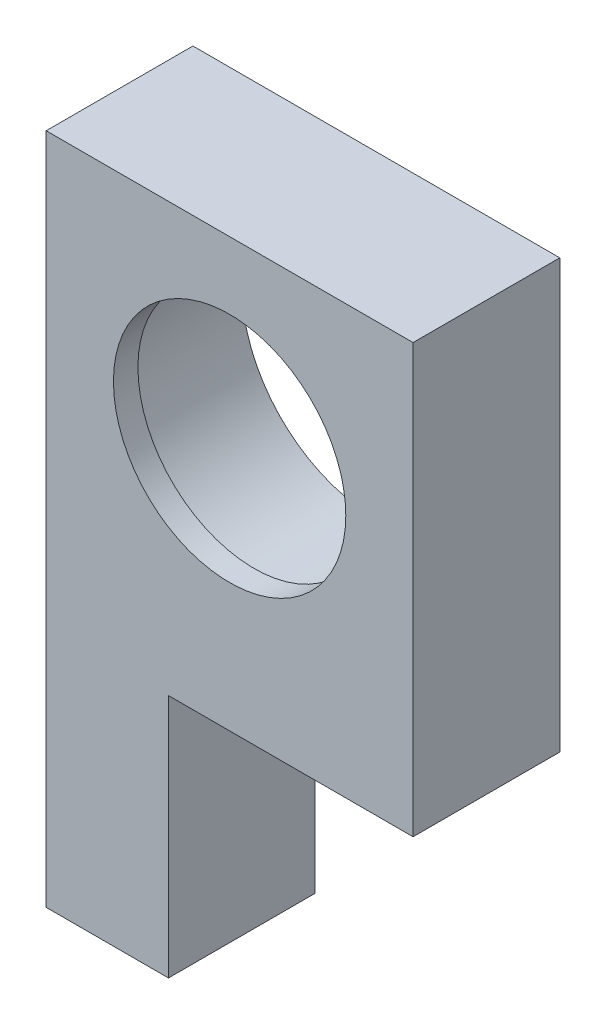
ISO-10303-21;
HEADER;
FILE_DESCRIPTION(('STEP AP214'),'2;1');
FILE_NAME('part.step','',(''),(''),'','','');
FILE_SCHEMA(('AUTOMOTIVE_DESIGN { 1 0 10303 214 1 1 1 1 }'));
ENDSEC;
DATA;
#1=APPLICATION_CONTEXT('core data for automotive mechanical design processes');
#2=APPLICATION_PROTOCOL_DEFINITION('international standard','automotive_design',2000,#1);
#3=PRODUCT_CONTEXT('',#1,'mechanical');
#4=PRODUCT('Part','Part','',(#3));
#5=PRODUCT_RELATED_PRODUCT_CATEGORY('part','',(#4));
#6=PRODUCT_DEFINITION_FORMATION('','',#4);
#7=PRODUCT_DEFINITION_CONTEXT('part definition',#1,'design');
#8=PRODUCT_DEFINITION('design','',#6,#7);
#9=PRODUCT_DEFINITION_SHAPE('','',#8);
#10=(LENGTH_UNIT() NAMED_UNIT(*) SI_UNIT(.MILLI.,.METRE.));
#11=(NAMED_UNIT(*) PLANE_ANGLE_UNIT() SI_UNIT($,.RADIAN.));
#12=(NAMED_UNIT(*) SI_UNIT($,.STERADIAN.) SOLID_ANGLE_UNIT());
#13=UNCERTAINTY_MEASURE_WITH_UNIT(LENGTH_MEASURE(1.E-05),#10,'distance_accuracy_value','');
#14=(GEOMETRIC_REPRESENTATION_CONTEXT(3) GLOBAL_UNCERTAINTY_ASSIGNED_CONTEXT((#13)) GLOBAL_UNIT_ASSIGNED_CONTEXT((#10,
#11,#12)) REPRESENTATION_CONTEXT('',''));
#15=CARTESIAN_POINT('',(0.,0.,0.));
#16=DIRECTION('',(0.,0.,1.));
#17=DIRECTION('',(1.,0.,0.));
#18=AXIS2_PLACEMENT_3D('',#15,#16,#17);
#19=CARTESIAN_POINT('',(0.,0.,12.));
#20=DIRECTION('',(0.,0.,-1.));
#21=DIRECTION('',(-1.,0.,0.));
#22=AXIS2_PLACEMENT_3D('',#19,#20,#21);
#23=CYLINDRICAL_SURFACE('',#22,9.5);
#24=CARTESIAN_POINT('',(0.,0.,12.));
#25=DIRECTION('',(0.,0.,1.));
#26=DIRECTION('',(1.,0.,0.));
#27=AXIS2_PLACEMENT_3D('',#24,#25,#26);
#28=CIRCLE('',#27,9.5);
#29=CARTESIAN_POINT('',(9.5,0.,12.));
#30=VERTEX_POINT('',#29);
#31=EDGE_CURVE('E124',#30,#30,#28,.T.);
#32=ORIENTED_EDGE('',*,*,#31,.T.);
#33=EDGE_LOOP('',(#32));
#34=FACE_BOUND('',#33,.T.);
#35=CARTESIAN_POINT('',(0.,0.,10.));
#36=DIRECTION('',(0.,0.,-1.));
#37=DIRECTION('',(-1.,0.,0.));
#38=AXIS2_PLACEMENT_3D('',#35,#36,#37);
#39=CIRCLE('',#38,9.5);
#40=CARTESIAN_POINT('',(-9.5,0.,10.));
#41=VERTEX_POINT('',#40);
#42=EDGE_CURVE('E37',#41,#41,#39,.T.);
#43=ORIENTED_EDGE('',*,*,#42,.T.);
#44=EDGE_LOOP('',(#43));
#45=FACE_BOUND('',#44,.T.);
#46=ADVANCED_FACE('F33',(#34,#45),#23,.F.);
#47=CARTESIAN_POINT('',(0.,0.,12.));
#48=DIRECTION('',(0.,0.,1.));
#49=DIRECTION('',(1.,0.,0.));
#50=AXIS2_PLACEMENT_3D('',#47,#48,#49);
#51=PLANE('',#50);
#52=DIRECTION('',(0.,-1.,0.));
#53=VECTOR('',#52,1.);
#54=CARTESIAN_POINT('',(-15.,15.,12.));
#55=LINE('',#54,#53);
#56=CARTESIAN_POINT('',(-15.,15.,12.));
#57=VERTEX_POINT('',#56);
#58=CARTESIAN_POINT('',(-15.,-40.,12.));
#59=VERTEX_POINT('',#58);
#60=EDGE_CURVE('E131',#57,#59,#55,.T.);
#61=ORIENTED_EDGE('',*,*,#60,.T.);
#62=DIRECTION('',(1.,0.,0.));
#63=VECTOR('',#62,1.);
#64=CARTESIAN_POINT('',(-15.,-40.,12.));
#65=LINE('',#64,#63);
#66=CARTESIAN_POINT('',(-5.,-40.,12.));
#67=VERTEX_POINT('',#66);
#68=EDGE_CURVE('E88',#59,#67,#65,.T.);
#69=ORIENTED_EDGE('',*,*,#68,.T.);
#70=DIRECTION('',(0.,1.,0.));
#71=VECTOR('',#70,1.);
#72=CARTESIAN_POINT('',(-5.,-40.,12.));
#73=LINE('',#72,#71);
#74=CARTESIAN_POINT('',(-5.,-20.,12.));
#75=VERTEX_POINT('',#74);
#76=EDGE_CURVE('E102',#67,#75,#73,.T.);
#77=ORIENTED_EDGE('',*,*,#76,.T.);
#78=DIRECTION('',(1.,0.,0.));
#79=VECTOR('',#78,1.);
#80=CARTESIAN_POINT('',(15.,-20.,12.));
#81=LINE('',#80,#79);
#82=CARTESIAN_POINT('',(15.,-20.,12.));
#83=VERTEX_POINT('',#82);
#84=EDGE_CURVE('E95',#75,#83,#81,.T.);
#85=ORIENTED_EDGE('',*,*,#84,.T.);
#86=DIRECTION('',(0.,1.,0.));
#87=VECTOR('',#86,1.);
#88=CARTESIAN_POINT('',(15.,-20.,12.));
#89=LINE('',#88,#87);
#90=CARTESIAN_POINT('',(15.,15.,12.));
#91=VERTEX_POINT('',#90);
#92=EDGE_CURVE('E100',#83,#91,#89,.T.);
#93=ORIENTED_EDGE('',*,*,#92,.T.);
#94=DIRECTION('',(-1.,0.,0.));
#95=VECTOR('',#94,1.);
#96=CARTESIAN_POINT('',(15.,15.,12.));
#97=LINE('',#96,#95);
#98=EDGE_CURVE('E51',#91,#57,#97,.T.);
#99=ORIENTED_EDGE('',*,*,#98,.T.);
#100=EDGE_LOOP('',(#61,#69,#77,#85,#93,#99));
#101=FACE_BOUND('',#100,.T.);
#102=ORIENTED_EDGE('',*,*,#31,.F.);
#103=EDGE_LOOP('',(#102));
#104=FACE_BOUND('',#103,.T.);
#105=ADVANCED_FACE('F97',(#101,#104),#51,.T.);
#106=CARTESIAN_POINT('',(0.,0.,0.));
#107=DIRECTION('',(0.,0.,1.));
#108=DIRECTION('',(1.,0.,0.));
#109=AXIS2_PLACEMENT_3D('',#106,#107,#108);
#110=PLANE('',#109);
#111=CARTESIAN_POINT('',(0.,0.,0.));
#112=DIRECTION('',(0.,0.,-1.));
#113=DIRECTION('',(-1.,0.,0.));
#114=AXIS2_PLACEMENT_3D('',#111,#112,#113);
#115=CIRCLE('',#114,11.);
#116=CARTESIAN_POINT('',(-11.,0.,0.));
#117=VERTEX_POINT('',#116);
#118=EDGE_CURVE('E176',#117,#117,#115,.T.);
#119=ORIENTED_EDGE('',*,*,#118,.F.);
#120=EDGE_LOOP('',(#119));
#121=FACE_BOUND('',#120,.T.);
#122=DIRECTION('',(0.,-1.,0.));
#123=VECTOR('',#122,1.);
#124=CARTESIAN_POINT('',(-15.,15.,0.));
#125=LINE('',#124,#123);
#126=CARTESIAN_POINT('',(-15.,15.,0.));
#127=VERTEX_POINT('',#126);
#128=CARTESIAN_POINT('',(-15.,-40.,0.));
#129=VERTEX_POINT('',#128);
#130=EDGE_CURVE('E120',#127,#129,#125,.T.);
#131=ORIENTED_EDGE('',*,*,#130,.F.);
#132=DIRECTION('',(-1.,0.,0.));
#133=VECTOR('',#132,1.);
#134=CARTESIAN_POINT('',(15.,15.,0.));
#135=LINE('',#134,#133);
#136=CARTESIAN_POINT('',(15.,15.,0.));
#137=VERTEX_POINT('',#136);
#138=EDGE_CURVE('E80',#137,#127,#135,.T.);
#139=ORIENTED_EDGE('',*,*,#138,.F.);
#140=DIRECTION('',(0.,1.,0.));
#141=VECTOR('',#140,1.);
#142=CARTESIAN_POINT('',(15.,-20.,0.));
#143=LINE('',#142,#141);
#144=CARTESIAN_POINT('',(15.,-20.,0.));
#145=VERTEX_POINT('',#144);
#146=EDGE_CURVE('E74',#145,#137,#143,.T.);
#147=ORIENTED_EDGE('',*,*,#146,.F.);
#148=DIRECTION('',(1.,0.,0.));
#149=VECTOR('',#148,1.);
#150=CARTESIAN_POINT('',(15.,-20.,0.));
#151=LINE('',#150,#149);
#152=CARTESIAN_POINT('',(-5.,-20.,0.));
#153=VERTEX_POINT('',#152);
#154=EDGE_CURVE('E110',#153,#145,#151,.T.);
#155=ORIENTED_EDGE('',*,*,#154,.F.);
#156=DIRECTION('',(0.,1.,0.));
#157=VECTOR('',#156,1.);
#158=CARTESIAN_POINT('',(-5.,-40.,0.));
#159=LINE('',#158,#157);
#160=CARTESIAN_POINT('',(-5.,-40.,0.));
#161=VERTEX_POINT('',#160);
#162=EDGE_CURVE('E126',#161,#153,#159,.T.);
#163=ORIENTED_EDGE('',*,*,#162,.F.);
#164=DIRECTION('',(1.,0.,0.));
#165=VECTOR('',#164,1.);
#166=CARTESIAN_POINT('',(-15.,-40.,0.));
#167=LINE('',#166,#165);
#168=EDGE_CURVE('E123',#129,#161,#167,.T.);
#169=ORIENTED_EDGE('',*,*,#168,.F.);
#170=EDGE_LOOP('',(#131,#139,#147,#155,#163,#169));
#171=FACE_BOUND('',#170,.T.);
#172=ADVANCED_FACE('F141',(#121,#171),#110,.F.);
#173=CARTESIAN_POINT('',(-15.,15.,12.));
#174=DIRECTION('',(1.,0.,0.));
#175=DIRECTION('',(0.,1.,0.));
#176=AXIS2_PLACEMENT_3D('',#173,#174,#175);
#177=PLANE('',#176);
#178=ORIENTED_EDGE('',*,*,#130,.T.);
#179=DIRECTION('',(0.,0.,-1.));
#180=VECTOR('',#179,1.);
#181=CARTESIAN_POINT('',(-15.,-40.,12.));
#182=LINE('',#181,#180);
#183=EDGE_CURVE('E11',#59,#129,#182,.T.);
#184=ORIENTED_EDGE('',*,*,#183,.F.);
#185=ORIENTED_EDGE('',*,*,#60,.F.);
#186=DIRECTION('',(0.,0.,-1.));
#187=VECTOR('',#186,1.);
#188=CARTESIAN_POINT('',(-15.,15.,12.));
#189=LINE('',#188,#187);
#190=EDGE_CURVE('E116',#57,#127,#189,.T.);
#191=ORIENTED_EDGE('',*,*,#190,.T.);
#192=EDGE_LOOP('',(#178,#184,#185,#191));
#193=FACE_BOUND('',#192,.T.);
#194=ADVANCED_FACE('F35',(#193),#177,.F.);
#195=CARTESIAN_POINT('',(-15.,-40.,12.));
#196=DIRECTION('',(0.,1.,0.));
#197=DIRECTION('',(-1.,0.,0.));
#198=AXIS2_PLACEMENT_3D('',#195,#196,#197);
#199=PLANE('',#198);
#200=ORIENTED_EDGE('',*,*,#168,.T.);
#201=DIRECTION('',(0.,0.,-1.));
#202=VECTOR('',#201,1.);
#203=CARTESIAN_POINT('',(-5.,-40.,12.));
#204=LINE('',#203,#202);
#205=EDGE_CURVE('E43',#67,#161,#204,.T.);
#206=ORIENTED_EDGE('',*,*,#205,.F.);
#207=ORIENTED_EDGE('',*,*,#68,.F.);
#208=ORIENTED_EDGE('',*,*,#183,.T.);
#209=EDGE_LOOP('',(#200,#206,#207,#208));
#210=FACE_BOUND('',#209,.T.);
#211=ADVANCED_FACE('F173',(#210),#199,.F.);
#212=CARTESIAN_POINT('',(-5.,-40.,12.));
#213=DIRECTION('',(-1.,0.,0.));
#214=DIRECTION('',(0.,-1.,0.));
#215=AXIS2_PLACEMENT_3D('',#212,#213,#214);
#216=PLANE('',#215);
#217=ORIENTED_EDGE('',*,*,#162,.T.);
#218=DIRECTION('',(0.,0.,-1.));
#219=VECTOR('',#218,1.);
#220=CARTESIAN_POINT('',(-5.,-20.,12.));
#221=LINE('',#220,#219);
#222=EDGE_CURVE('E111',#75,#153,#221,.T.);
#223=ORIENTED_EDGE('',*,*,#222,.F.);
#224=ORIENTED_EDGE('',*,*,#76,.F.);
#225=ORIENTED_EDGE('',*,*,#205,.T.);
#226=EDGE_LOOP('',(#217,#223,#224,#225));
#227=FACE_BOUND('',#226,.T.);
#228=ADVANCED_FACE('F138',(#227),#216,.F.);
#229=CARTESIAN_POINT('',(15.,-20.,12.));
#230=DIRECTION('',(0.,1.,0.));
#231=DIRECTION('',(-1.,0.,0.));
#232=AXIS2_PLACEMENT_3D('',#229,#230,#231);
#233=PLANE('',#232);
#234=ORIENTED_EDGE('',*,*,#154,.T.);
#235=DIRECTION('',(0.,0.,-1.));
#236=VECTOR('',#235,1.);
#237=CARTESIAN_POINT('',(15.,-20.,12.));
#238=LINE('',#237,#236);
#239=EDGE_CURVE('E107',#83,#145,#238,.T.);
#240=ORIENTED_EDGE('',*,*,#239,.F.);
#241=ORIENTED_EDGE('',*,*,#84,.F.);
#242=ORIENTED_EDGE('',*,*,#222,.T.);
#243=EDGE_LOOP('',(#234,#240,#241,#242));
#244=FACE_BOUND('',#243,.T.);
#245=ADVANCED_FACE('F108',(#244),#233,.F.);
#246=CARTESIAN_POINT('',(15.,-20.,12.));
#247=DIRECTION('',(-1.,0.,0.));
#248=DIRECTION('',(0.,0.,1.));
#249=AXIS2_PLACEMENT_3D('',#246,#247,#248);
#250=PLANE('',#249);
#251=ORIENTED_EDGE('',*,*,#146,.T.);
#252=DIRECTION('',(0.,0.,-1.));
#253=VECTOR('',#252,1.);
#254=CARTESIAN_POINT('',(15.,15.,12.));
#255=LINE('',#254,#253);
#256=EDGE_CURVE('E112',#91,#137,#255,.T.);
#257=ORIENTED_EDGE('',*,*,#256,.F.);
#258=ORIENTED_EDGE('',*,*,#92,.F.);
#259=ORIENTED_EDGE('',*,*,#239,.T.);
#260=EDGE_LOOP('',(#251,#257,#258,#259));
#261=FACE_BOUND('',#260,.T.);
#262=ADVANCED_FACE('F114',(#261),#250,.F.);
#263=CARTESIAN_POINT('',(15.,15.,12.));
#264=DIRECTION('',(0.,-1.,0.));
#265=DIRECTION('',(1.,0.,0.));
#266=AXIS2_PLACEMENT_3D('',#263,#264,#265);
#267=PLANE('',#266);
#268=ORIENTED_EDGE('',*,*,#138,.T.);
#269=ORIENTED_EDGE('',*,*,#190,.F.);
#270=ORIENTED_EDGE('',*,*,#98,.F.);
#271=ORIENTED_EDGE('',*,*,#256,.T.);
#272=EDGE_LOOP('',(#268,#269,#270,#271));
#273=FACE_BOUND('',#272,.T.);
#274=ADVANCED_FACE('F145',(#273),#267,.F.);
#275=CARTESIAN_POINT('',(0.,0.,10.));
#276=DIRECTION('',(0.,0.,-1.));
#277=DIRECTION('',(-1.,0.,0.));
#278=AXIS2_PLACEMENT_3D('',#275,#276,#277);
#279=CYLINDRICAL_SURFACE('',#278,11.);
#280=CARTESIAN_POINT('',(0.,0.,10.));
#281=DIRECTION('',(0.,0.,-1.));
#282=DIRECTION('',(-1.,0.,0.));
#283=AXIS2_PLACEMENT_3D('',#280,#281,#282);
#284=CIRCLE('',#283,11.);
#285=CARTESIAN_POINT('',(-11.,0.,10.));
#286=VERTEX_POINT('',#285);
#287=EDGE_CURVE('E178',#286,#286,#284,.T.);
#288=ORIENTED_EDGE('',*,*,#287,.F.);
#289=EDGE_LOOP('',(#288));
#290=FACE_BOUND('',#289,.T.);
#291=ORIENTED_EDGE('',*,*,#118,.T.);
#292=EDGE_LOOP('',(#291));
#293=FACE_BOUND('',#292,.T.);
#294=ADVANCED_FACE('F147',(#290,#293),#279,.F.);
#295=CARTESIAN_POINT('',(0.,0.,10.));
#296=DIRECTION('',(0.,0.,-1.));
#297=DIRECTION('',(-1.,0.,0.));
#298=AXIS2_PLACEMENT_3D('',#295,#296,#297);
#299=PLANE('',#298);
#300=ORIENTED_EDGE('',*,*,#42,.F.);
#301=EDGE_LOOP('',(#300));
#302=FACE_BOUND('',#301,.T.);
#303=ORIENTED_EDGE('',*,*,#287,.T.);
#304=EDGE_LOOP('',(#303));
#305=FACE_BOUND('',#304,.T.);
#306=ADVANCED_FACE('F153',(#302,#305),#299,.T.);
#307=CLOSED_SHELL('',(#46,#105,#172,#194,#211,#228,#245,#262,#274,#294,#306));
#308=MANIFOLD_SOLID_BREP('B2',#307);
#309=ADVANCED_BREP_SHAPE_REPRESENTATION('',(#18,#308),#14);
#310=SHAPE_DEFINITION_REPRESENTATION(#9,#309);
ENDSEC;
END-ISO-10303-21;
